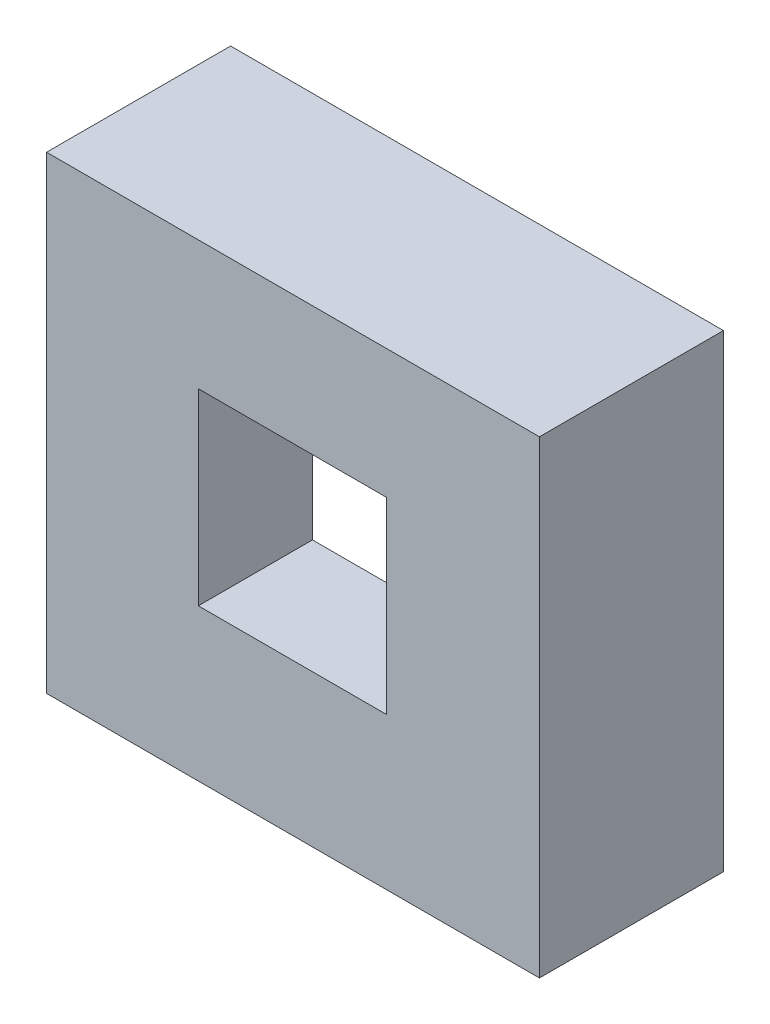
ISO-10303-21;
HEADER;
FILE_DESCRIPTION(('STEP AP214'),'2;1');
FILE_NAME('part.step','',(''),(''),'','','');
FILE_SCHEMA(('AUTOMOTIVE_DESIGN { 1 0 10303 214 1 1 1 1 }'));
ENDSEC;
DATA;
#1=APPLICATION_CONTEXT('core data for automotive mechanical design processes');
#2=APPLICATION_PROTOCOL_DEFINITION('international standard','automotive_design',2000,#1);
#3=PRODUCT_CONTEXT('',#1,'mechanical');
#4=PRODUCT('Part','Part','',(#3));
#5=PRODUCT_RELATED_PRODUCT_CATEGORY('part','',(#4));
#6=PRODUCT_DEFINITION_FORMATION('','',#4);
#7=PRODUCT_DEFINITION_CONTEXT('part definition',#1,'design');
#8=PRODUCT_DEFINITION('design','',#6,#7);
#9=PRODUCT_DEFINITION_SHAPE('','',#8);
#10=(LENGTH_UNIT() NAMED_UNIT(*) SI_UNIT(.MILLI.,.METRE.));
#11=(NAMED_UNIT(*) PLANE_ANGLE_UNIT() SI_UNIT($,.RADIAN.));
#12=(NAMED_UNIT(*) SI_UNIT($,.STERADIAN.) SOLID_ANGLE_UNIT());
#13=UNCERTAINTY_MEASURE_WITH_UNIT(LENGTH_MEASURE(1.E-05),#10,'distance_accuracy_value','');
#14=(GEOMETRIC_REPRESENTATION_CONTEXT(3) GLOBAL_UNCERTAINTY_ASSIGNED_CONTEXT((#13)) GLOBAL_UNIT_ASSIGNED_CONTEXT((#10,
#11,#12)) REPRESENTATION_CONTEXT('',''));
#15=CARTESIAN_POINT('',(0.,0.,0.));
#16=DIRECTION('',(0.,0.,1.));
#17=DIRECTION('',(1.,0.,0.));
#18=AXIS2_PLACEMENT_3D('',#15,#16,#17);
#19=CARTESIAN_POINT('',(0.,0.,11.2));
#20=DIRECTION('',(0.,0.,1.));
#21=DIRECTION('',(1.,0.,0.));
#22=AXIS2_PLACEMENT_3D('',#19,#20,#21);
#23=PLANE('',#22);
#24=DIRECTION('',(0.,-1.,0.));
#25=VECTOR('',#24,1.);
#26=CARTESIAN_POINT('',(1.,1.,11.2));
#27=LINE('',#26,#25);
#28=CARTESIAN_POINT('',(1.,33.9,11.2));
#29=VERTEX_POINT('',#28);
#30=CARTESIAN_POINT('',(1.,1.,11.2));
#31=VERTEX_POINT('',#30);
#32=EDGE_CURVE('E278',#29,#31,#27,.T.);
#33=ORIENTED_EDGE('',*,*,#32,.F.);
#34=DIRECTION('',(-1.,0.,0.));
#35=VECTOR('',#34,1.);
#36=CARTESIAN_POINT('',(1.,33.9,11.2));
#37=LINE('',#36,#35);
#38=CARTESIAN_POINT('',(35.7,33.9,11.2));
#39=VERTEX_POINT('',#38);
#40=EDGE_CURVE('E288',#39,#29,#37,.T.);
#41=ORIENTED_EDGE('',*,*,#40,.F.);
#42=DIRECTION('',(0.,1.,0.));
#43=VECTOR('',#42,1.);
#44=CARTESIAN_POINT('',(35.7,1.,11.2));
#45=LINE('',#44,#43);
#46=CARTESIAN_POINT('',(35.7,1.,11.2));
#47=VERTEX_POINT('',#46);
#48=EDGE_CURVE('E285',#47,#39,#45,.T.);
#49=ORIENTED_EDGE('',*,*,#48,.F.);
#50=DIRECTION('',(1.,0.,0.));
#51=VECTOR('',#50,1.);
#52=CARTESIAN_POINT('',(1.,1.,11.2));
#53=LINE('',#52,#51);
#54=EDGE_CURVE('E281',#31,#47,#53,.T.);
#55=ORIENTED_EDGE('',*,*,#54,.F.);
#56=EDGE_LOOP('',(#33,#41,#49,#55));
#57=FACE_BOUND('',#56,.T.);
#58=DIRECTION('',(0.,1.,0.));
#59=VECTOR('',#58,1.);
#60=CARTESIAN_POINT('',(10.3,10.3,11.2));
#61=LINE('',#60,#59);
#62=CARTESIAN_POINT('',(10.3,10.3,11.2));
#63=VERTEX_POINT('',#62);
#64=CARTESIAN_POINT('',(10.3,26.3,11.2));
#65=VERTEX_POINT('',#64);
#66=EDGE_CURVE('E200',#63,#65,#61,.T.);
#67=ORIENTED_EDGE('',*,*,#66,.F.);
#68=DIRECTION('',(-1.,0.,0.));
#69=VECTOR('',#68,1.);
#70=CARTESIAN_POINT('',(10.3,10.3,11.2));
#71=LINE('',#70,#69);
#72=CARTESIAN_POINT('',(26.3,10.3,11.2));
#73=VERTEX_POINT('',#72);
#74=EDGE_CURVE('E205',#73,#63,#71,.T.);
#75=ORIENTED_EDGE('',*,*,#74,.F.);
#76=DIRECTION('',(0.,-1.,0.));
#77=VECTOR('',#76,1.);
#78=CARTESIAN_POINT('',(26.3,10.3,11.2));
#79=LINE('',#78,#77);
#80=CARTESIAN_POINT('',(26.3,26.3,11.2));
#81=VERTEX_POINT('',#80);
#82=EDGE_CURVE('E55',#81,#73,#79,.T.);
#83=ORIENTED_EDGE('',*,*,#82,.F.);
#84=DIRECTION('',(1.,0.,0.));
#85=VECTOR('',#84,1.);
#86=CARTESIAN_POINT('',(10.3,26.3,11.2));
#87=LINE('',#86,#85);
#88=EDGE_CURVE('E50',#65,#81,#87,.T.);
#89=ORIENTED_EDGE('',*,*,#88,.F.);
#90=EDGE_LOOP('',(#67,#75,#83,#89));
#91=FACE_BOUND('',#90,.T.);
#92=ADVANCED_FACE('F35',(#57,#91),#23,.F.);
#93=CARTESIAN_POINT('',(0.,0.,0.));
#94=DIRECTION('',(0.,0.,-1.));
#95=DIRECTION('',(-1.,0.,0.));
#96=AXIS2_PLACEMENT_3D('',#93,#94,#95);
#97=PLANE('',#96);
#98=DIRECTION('',(0.,-1.,0.));
#99=VECTOR('',#98,1.);
#100=CARTESIAN_POINT('',(30.7,1.,0.));
#101=LINE('',#100,#99);
#102=CARTESIAN_POINT('',(30.7,1.,0.));
#103=VERTEX_POINT('',#102);
#104=CARTESIAN_POINT('',(30.7,0.,0.));
#105=VERTEX_POINT('',#104);
#106=EDGE_CURVE('E252',#103,#105,#101,.T.);
#107=ORIENTED_EDGE('',*,*,#106,.F.);
#108=DIRECTION('',(1.,0.,0.));
#109=VECTOR('',#108,1.);
#110=CARTESIAN_POINT('',(1.,1.,0.));
#111=LINE('',#110,#109);
#112=CARTESIAN_POINT('',(35.7,1.,0.));
#113=VERTEX_POINT('',#112);
#114=EDGE_CURVE('E294',#103,#113,#111,.T.);
#115=ORIENTED_EDGE('',*,*,#114,.T.);
#116=DIRECTION('',(0.,1.,0.));
#117=VECTOR('',#116,1.);
#118=CARTESIAN_POINT('',(35.7,1.,0.));
#119=LINE('',#118,#117);
#120=CARTESIAN_POINT('',(35.7,33.9,0.));
#121=VERTEX_POINT('',#120);
#122=EDGE_CURVE('E298',#113,#121,#119,.T.);
#123=ORIENTED_EDGE('',*,*,#122,.T.);
#124=DIRECTION('',(-1.,0.,0.));
#125=VECTOR('',#124,1.);
#126=CARTESIAN_POINT('',(1.,33.9,0.));
#127=LINE('',#126,#125);
#128=CARTESIAN_POINT('',(1.,33.9,0.));
#129=VERTEX_POINT('',#128);
#130=EDGE_CURVE('E282',#121,#129,#127,.T.);
#131=ORIENTED_EDGE('',*,*,#130,.T.);
#132=DIRECTION('',(0.,-1.,0.));
#133=VECTOR('',#132,1.);
#134=CARTESIAN_POINT('',(1.,1.,0.));
#135=LINE('',#134,#133);
#136=CARTESIAN_POINT('',(1.,1.,0.));
#137=VERTEX_POINT('',#136);
#138=EDGE_CURVE('E270',#129,#137,#135,.T.);
#139=ORIENTED_EDGE('',*,*,#138,.T.);
#140=CARTESIAN_POINT('',(25.8,1.,0.));
#141=VERTEX_POINT('',#140);
#142=EDGE_CURVE('E295',#137,#141,#111,.T.);
#143=ORIENTED_EDGE('',*,*,#142,.T.);
#144=DIRECTION('',(0.,1.,0.));
#145=VECTOR('',#144,1.);
#146=CARTESIAN_POINT('',(25.8,1.,0.));
#147=LINE('',#146,#145);
#148=CARTESIAN_POINT('',(25.8,0.,0.));
#149=VERTEX_POINT('',#148);
#150=EDGE_CURVE('E257',#149,#141,#147,.T.);
#151=ORIENTED_EDGE('',*,*,#150,.F.);
#152=DIRECTION('',(1.,0.,0.));
#153=VECTOR('',#152,1.);
#154=CARTESIAN_POINT('',(0.,0.,0.));
#155=LINE('',#154,#153);
#156=CARTESIAN_POINT('',(0.,0.,0.));
#157=VERTEX_POINT('',#156);
#158=EDGE_CURVE('E317',#157,#149,#155,.T.);
#159=ORIENTED_EDGE('',*,*,#158,.F.);
#160=DIRECTION('',(0.,-1.,0.));
#161=VECTOR('',#160,1.);
#162=CARTESIAN_POINT('',(0.,0.,0.));
#163=LINE('',#162,#161);
#164=CARTESIAN_POINT('',(0.,34.9,0.));
#165=VERTEX_POINT('',#164);
#166=EDGE_CURVE('E313',#165,#157,#163,.T.);
#167=ORIENTED_EDGE('',*,*,#166,.F.);
#168=DIRECTION('',(-1.,0.,0.));
#169=VECTOR('',#168,1.);
#170=CARTESIAN_POINT('',(0.,34.9,0.));
#171=LINE('',#170,#169);
#172=CARTESIAN_POINT('',(36.7,34.9,0.));
#173=VERTEX_POINT('',#172);
#174=EDGE_CURVE('E322',#173,#165,#171,.T.);
#175=ORIENTED_EDGE('',*,*,#174,.F.);
#176=DIRECTION('',(0.,1.,0.));
#177=VECTOR('',#176,1.);
#178=CARTESIAN_POINT('',(36.7,0.,0.));
#179=LINE('',#178,#177);
#180=CARTESIAN_POINT('',(36.7,0.,0.));
#181=VERTEX_POINT('',#180);
#182=EDGE_CURVE('E320',#181,#173,#179,.T.);
#183=ORIENTED_EDGE('',*,*,#182,.F.);
#184=EDGE_CURVE('E316',#105,#181,#155,.T.);
#185=ORIENTED_EDGE('',*,*,#184,.F.);
#186=EDGE_LOOP('',(#107,#115,#123,#131,#139,#143,#151,#159,#167,#175,#183,#185));
#187=FACE_BOUND('',#186,.T.);
#188=ADVANCED_FACE('F340',(#187),#97,.T.);
#189=CARTESIAN_POINT('',(0.,0.,11.2));
#190=DIRECTION('',(1.,0.,0.));
#191=DIRECTION('',(0.,1.,0.));
#192=AXIS2_PLACEMENT_3D('',#189,#190,#191);
#193=PLANE('',#192);
#194=ORIENTED_EDGE('',*,*,#166,.T.);
#195=DIRECTION('',(0.,0.,-1.));
#196=VECTOR('',#195,1.);
#197=CARTESIAN_POINT('',(0.,0.,11.2));
#198=LINE('',#197,#196);
#199=CARTESIAN_POINT('',(0.,0.,13.7));
#200=VERTEX_POINT('',#199);
#201=EDGE_CURVE('E11',#200,#157,#198,.T.);
#202=ORIENTED_EDGE('',*,*,#201,.F.);
#203=DIRECTION('',(0.,-1.,0.));
#204=VECTOR('',#203,1.);
#205=CARTESIAN_POINT('',(0.,0.,13.7));
#206=LINE('',#205,#204);
#207=CARTESIAN_POINT('',(0.,34.9,13.7));
#208=VERTEX_POINT('',#207);
#209=EDGE_CURVE('E246',#208,#200,#206,.T.);
#210=ORIENTED_EDGE('',*,*,#209,.F.);
#211=DIRECTION('',(0.,0.,-1.));
#212=VECTOR('',#211,1.);
#213=CARTESIAN_POINT('',(0.,34.9,11.2));
#214=LINE('',#213,#212);
#215=EDGE_CURVE('E324',#208,#165,#214,.T.);
#216=ORIENTED_EDGE('',*,*,#215,.T.);
#217=EDGE_LOOP('',(#194,#202,#210,#216));
#218=FACE_BOUND('',#217,.T.);
#219=ADVANCED_FACE('F37',(#218),#193,.F.);
#220=CARTESIAN_POINT('',(0.,0.,11.2));
#221=DIRECTION('',(0.,1.,0.));
#222=DIRECTION('',(0.,0.,1.));
#223=AXIS2_PLACEMENT_3D('',#220,#221,#222);
#224=PLANE('',#223);
#225=DIRECTION('',(-1.,0.,0.));
#226=VECTOR('',#225,1.);
#227=CARTESIAN_POINT('',(30.7,0.,1.9));
#228=LINE('',#227,#226);
#229=CARTESIAN_POINT('',(30.7,0.,1.9));
#230=VERTEX_POINT('',#229);
#231=CARTESIAN_POINT('',(25.8,0.,1.9));
#232=VERTEX_POINT('',#231);
#233=EDGE_CURVE('E256',#230,#232,#228,.T.);
#234=ORIENTED_EDGE('',*,*,#233,.F.);
#235=DIRECTION('',(0.,0.,-1.));
#236=VECTOR('',#235,1.);
#237=CARTESIAN_POINT('',(30.7,0.,1.9));
#238=LINE('',#237,#236);
#239=EDGE_CURVE('E265',#230,#105,#238,.T.);
#240=ORIENTED_EDGE('',*,*,#239,.T.);
#241=ORIENTED_EDGE('',*,*,#184,.T.);
#242=DIRECTION('',(0.,0.,-1.));
#243=VECTOR('',#242,1.);
#244=CARTESIAN_POINT('',(36.7,0.,11.2));
#245=LINE('',#244,#243);
#246=CARTESIAN_POINT('',(36.7,0.,13.7));
#247=VERTEX_POINT('',#246);
#248=EDGE_CURVE('E43',#247,#181,#245,.T.);
#249=ORIENTED_EDGE('',*,*,#248,.F.);
#250=DIRECTION('',(1.,0.,0.));
#251=VECTOR('',#250,1.);
#252=CARTESIAN_POINT('',(36.7,0.,13.7));
#253=LINE('',#252,#251);
#254=EDGE_CURVE('E249',#200,#247,#253,.T.);
#255=ORIENTED_EDGE('',*,*,#254,.F.);
#256=ORIENTED_EDGE('',*,*,#201,.T.);
#257=ORIENTED_EDGE('',*,*,#158,.T.);
#258=DIRECTION('',(0.,0.,-1.));
#259=VECTOR('',#258,1.);
#260=CARTESIAN_POINT('',(25.8,0.,1.9));
#261=LINE('',#260,#259);
#262=EDGE_CURVE('E274',#232,#149,#261,.T.);
#263=ORIENTED_EDGE('',*,*,#262,.F.);
#264=EDGE_LOOP('',(#234,#240,#241,#249,#255,#256,#257,#263));
#265=FACE_BOUND('',#264,.T.);
#266=ADVANCED_FACE('F350',(#265),#224,.F.);
#267=CARTESIAN_POINT('',(36.7,0.,11.2));
#268=DIRECTION('',(-1.,0.,0.));
#269=DIRECTION('',(0.,-1.,0.));
#270=AXIS2_PLACEMENT_3D('',#267,#268,#269);
#271=PLANE('',#270);
#272=ORIENTED_EDGE('',*,*,#182,.T.);
#273=DIRECTION('',(0.,0.,-1.));
#274=VECTOR('',#273,1.);
#275=CARTESIAN_POINT('',(36.7,34.9,11.2));
#276=LINE('',#275,#274);
#277=CARTESIAN_POINT('',(36.7,34.9,13.7));
#278=VERTEX_POINT('',#277);
#279=EDGE_CURVE('E327',#278,#173,#276,.T.);
#280=ORIENTED_EDGE('',*,*,#279,.F.);
#281=DIRECTION('',(0.,1.,0.));
#282=VECTOR('',#281,1.);
#283=CARTESIAN_POINT('',(36.7,0.,13.7));
#284=LINE('',#283,#282);
#285=EDGE_CURVE('E180',#247,#278,#284,.T.);
#286=ORIENTED_EDGE('',*,*,#285,.F.);
#287=ORIENTED_EDGE('',*,*,#248,.T.);
#288=EDGE_LOOP('',(#272,#280,#286,#287));
#289=FACE_BOUND('',#288,.T.);
#290=ADVANCED_FACE('F333',(#289),#271,.F.);
#291=CARTESIAN_POINT('',(0.,34.9,11.2));
#292=DIRECTION('',(0.,-1.,0.));
#293=DIRECTION('',(0.,0.,-1.));
#294=AXIS2_PLACEMENT_3D('',#291,#292,#293);
#295=PLANE('',#294);
#296=ORIENTED_EDGE('',*,*,#174,.T.);
#297=ORIENTED_EDGE('',*,*,#215,.F.);
#298=DIRECTION('',(-1.,0.,0.));
#299=VECTOR('',#298,1.);
#300=CARTESIAN_POINT('',(36.7,34.9,13.7));
#301=LINE('',#300,#299);
#302=EDGE_CURVE('E243',#278,#208,#301,.T.);
#303=ORIENTED_EDGE('',*,*,#302,.F.);
#304=ORIENTED_EDGE('',*,*,#279,.T.);
#305=EDGE_LOOP('',(#296,#297,#303,#304));
#306=FACE_BOUND('',#305,.T.);
#307=ADVANCED_FACE('F343',(#306),#295,.F.);
#308=CARTESIAN_POINT('',(1.,1.,11.2));
#309=DIRECTION('',(1.,0.,0.));
#310=DIRECTION('',(0.,0.,-1.));
#311=AXIS2_PLACEMENT_3D('',#308,#309,#310);
#312=PLANE('',#311);
#313=ORIENTED_EDGE('',*,*,#138,.F.);
#314=DIRECTION('',(0.,0.,-1.));
#315=VECTOR('',#314,1.);
#316=CARTESIAN_POINT('',(1.,33.9,11.2));
#317=LINE('',#316,#315);
#318=EDGE_CURVE('E291',#29,#129,#317,.T.);
#319=ORIENTED_EDGE('',*,*,#318,.F.);
#320=ORIENTED_EDGE('',*,*,#32,.T.);
#321=DIRECTION('',(0.,0.,-1.));
#322=VECTOR('',#321,1.);
#323=CARTESIAN_POINT('',(1.,1.,11.2));
#324=LINE('',#323,#322);
#325=EDGE_CURVE('E310',#31,#137,#324,.T.);
#326=ORIENTED_EDGE('',*,*,#325,.T.);
#327=EDGE_LOOP('',(#313,#319,#320,#326));
#328=FACE_BOUND('',#327,.T.);
#329=ADVANCED_FACE('F376',(#328),#312,.T.);
#330=CARTESIAN_POINT('',(1.,1.,11.2));
#331=DIRECTION('',(0.,1.,0.));
#332=DIRECTION('',(0.,0.,1.));
#333=AXIS2_PLACEMENT_3D('',#330,#331,#332);
#334=PLANE('',#333);
#335=DIRECTION('',(0.,0.,-1.));
#336=VECTOR('',#335,1.);
#337=CARTESIAN_POINT('',(30.7,1.,1.9));
#338=LINE('',#337,#336);
#339=CARTESIAN_POINT('',(30.7,1.,1.9));
#340=VERTEX_POINT('',#339);
#341=EDGE_CURVE('E268',#340,#103,#338,.T.);
#342=ORIENTED_EDGE('',*,*,#341,.F.);
#343=DIRECTION('',(1.,0.,0.));
#344=VECTOR('',#343,1.);
#345=CARTESIAN_POINT('',(30.7,1.,1.9));
#346=LINE('',#345,#344);
#347=CARTESIAN_POINT('',(25.8,1.,1.9));
#348=VERTEX_POINT('',#347);
#349=EDGE_CURVE('E262',#348,#340,#346,.T.);
#350=ORIENTED_EDGE('',*,*,#349,.F.);
#351=DIRECTION('',(0.,0.,-1.));
#352=VECTOR('',#351,1.);
#353=CARTESIAN_POINT('',(25.8,1.,1.9));
#354=LINE('',#353,#352);
#355=EDGE_CURVE('E271',#348,#141,#354,.T.);
#356=ORIENTED_EDGE('',*,*,#355,.T.);
#357=ORIENTED_EDGE('',*,*,#142,.F.);
#358=ORIENTED_EDGE('',*,*,#325,.F.);
#359=ORIENTED_EDGE('',*,*,#54,.T.);
#360=DIRECTION('',(0.,0.,-1.));
#361=VECTOR('',#360,1.);
#362=CARTESIAN_POINT('',(35.7,1.,11.2));
#363=LINE('',#362,#361);
#364=EDGE_CURVE('E307',#47,#113,#363,.T.);
#365=ORIENTED_EDGE('',*,*,#364,.T.);
#366=ORIENTED_EDGE('',*,*,#114,.F.);
#367=EDGE_LOOP('',(#342,#350,#356,#357,#358,#359,#365,#366));
#368=FACE_BOUND('',#367,.T.);
#369=ADVANCED_FACE('F359',(#368),#334,.T.);
#370=CARTESIAN_POINT('',(35.7,1.,11.2));
#371=DIRECTION('',(-1.,0.,0.));
#372=DIRECTION('',(0.,0.,1.));
#373=AXIS2_PLACEMENT_3D('',#370,#371,#372);
#374=PLANE('',#373);
#375=ORIENTED_EDGE('',*,*,#122,.F.);
#376=ORIENTED_EDGE('',*,*,#364,.F.);
#377=ORIENTED_EDGE('',*,*,#48,.T.);
#378=DIRECTION('',(0.,0.,-1.));
#379=VECTOR('',#378,1.);
#380=CARTESIAN_POINT('',(35.7,33.9,11.2));
#381=LINE('',#380,#379);
#382=EDGE_CURVE('E305',#39,#121,#381,.T.);
#383=ORIENTED_EDGE('',*,*,#382,.T.);
#384=EDGE_LOOP('',(#375,#376,#377,#383));
#385=FACE_BOUND('',#384,.T.);
#386=ADVANCED_FACE('F369',(#385),#374,.T.);
#387=CARTESIAN_POINT('',(1.,33.9,11.2));
#388=DIRECTION('',(0.,-1.,0.));
#389=DIRECTION('',(0.,0.,-1.));
#390=AXIS2_PLACEMENT_3D('',#387,#388,#389);
#391=PLANE('',#390);
#392=ORIENTED_EDGE('',*,*,#130,.F.);
#393=ORIENTED_EDGE('',*,*,#382,.F.);
#394=ORIENTED_EDGE('',*,*,#40,.T.);
#395=ORIENTED_EDGE('',*,*,#318,.T.);
#396=EDGE_LOOP('',(#392,#393,#394,#395));
#397=FACE_BOUND('',#396,.T.);
#398=ADVANCED_FACE('F373',(#397),#391,.T.);
#399=CARTESIAN_POINT('',(30.7,1.,1.9));
#400=DIRECTION('',(1.,0.,0.));
#401=DIRECTION('',(0.,0.,-1.));
#402=AXIS2_PLACEMENT_3D('',#399,#400,#401);
#403=PLANE('',#402);
#404=ORIENTED_EDGE('',*,*,#106,.T.);
#405=ORIENTED_EDGE('',*,*,#239,.F.);
#406=DIRECTION('',(0.,-1.,0.));
#407=VECTOR('',#406,1.);
#408=CARTESIAN_POINT('',(30.7,1.,1.9));
#409=LINE('',#408,#407);
#410=EDGE_CURVE('E253',#340,#230,#409,.T.);
#411=ORIENTED_EDGE('',*,*,#410,.F.);
#412=ORIENTED_EDGE('',*,*,#341,.T.);
#413=EDGE_LOOP('',(#404,#405,#411,#412));
#414=FACE_BOUND('',#413,.T.);
#415=ADVANCED_FACE('F365',(#414),#403,.F.);
#416=CARTESIAN_POINT('',(25.8,1.,1.9));
#417=DIRECTION('',(-1.,0.,0.));
#418=DIRECTION('',(0.,0.,1.));
#419=AXIS2_PLACEMENT_3D('',#416,#417,#418);
#420=PLANE('',#419);
#421=ORIENTED_EDGE('',*,*,#150,.T.);
#422=ORIENTED_EDGE('',*,*,#355,.F.);
#423=DIRECTION('',(0.,1.,0.));
#424=VECTOR('',#423,1.);
#425=CARTESIAN_POINT('',(25.8,1.,1.9));
#426=LINE('',#425,#424);
#427=EDGE_CURVE('E260',#232,#348,#426,.T.);
#428=ORIENTED_EDGE('',*,*,#427,.F.);
#429=ORIENTED_EDGE('',*,*,#262,.T.);
#430=EDGE_LOOP('',(#421,#422,#428,#429));
#431=FACE_BOUND('',#430,.T.);
#432=ADVANCED_FACE('F355',(#431),#420,.F.);
#433=CARTESIAN_POINT('',(0.,0.,1.9));
#434=DIRECTION('',(0.,0.,-1.));
#435=DIRECTION('',(-1.,0.,0.));
#436=AXIS2_PLACEMENT_3D('',#433,#434,#435);
#437=PLANE('',#436);
#438=ORIENTED_EDGE('',*,*,#410,.T.);
#439=ORIENTED_EDGE('',*,*,#233,.T.);
#440=ORIENTED_EDGE('',*,*,#427,.T.);
#441=ORIENTED_EDGE('',*,*,#349,.T.);
#442=EDGE_LOOP('',(#438,#439,#440,#441));
#443=FACE_BOUND('',#442,.T.);
#444=ADVANCED_FACE('F363',(#443),#437,.T.);
#445=CARTESIAN_POINT('',(0.,0.,13.7));
#446=DIRECTION('',(0.,0.,1.));
#447=DIRECTION('',(1.,0.,0.));
#448=AXIS2_PLACEMENT_3D('',#445,#446,#447);
#449=PLANE('',#448);
#450=DIRECTION('',(0.,-1.,0.));
#451=VECTOR('',#450,1.);
#452=CARTESIAN_POINT('',(11.3,25.3,13.7));
#453=LINE('',#452,#451);
#454=CARTESIAN_POINT('',(11.3,25.3,13.7));
#455=VERTEX_POINT('',#454);
#456=CARTESIAN_POINT('',(11.3,11.3,13.7));
#457=VERTEX_POINT('',#456);
#458=EDGE_CURVE('E228',#455,#457,#453,.T.);
#459=ORIENTED_EDGE('',*,*,#458,.F.);
#460=DIRECTION('',(-1.,0.,0.));
#461=VECTOR('',#460,1.);
#462=CARTESIAN_POINT('',(11.3,25.3,13.7));
#463=LINE('',#462,#461);
#464=CARTESIAN_POINT('',(25.3,25.3,13.7));
#465=VERTEX_POINT('',#464);
#466=EDGE_CURVE('E177',#465,#455,#463,.T.);
#467=ORIENTED_EDGE('',*,*,#466,.F.);
#468=DIRECTION('',(0.,1.,0.));
#469=VECTOR('',#468,1.);
#470=CARTESIAN_POINT('',(25.3,25.3,13.7));
#471=LINE('',#470,#469);
#472=CARTESIAN_POINT('',(25.3,11.3,13.7));
#473=VERTEX_POINT('',#472);
#474=EDGE_CURVE('E233',#473,#465,#471,.T.);
#475=ORIENTED_EDGE('',*,*,#474,.F.);
#476=DIRECTION('',(1.,0.,0.));
#477=VECTOR('',#476,1.);
#478=CARTESIAN_POINT('',(11.3,11.3,13.7));
#479=LINE('',#478,#477);
#480=EDGE_CURVE('E230',#457,#473,#479,.T.);
#481=ORIENTED_EDGE('',*,*,#480,.F.);
#482=EDGE_LOOP('',(#459,#467,#475,#481));
#483=FACE_BOUND('',#482,.T.);
#484=ORIENTED_EDGE('',*,*,#285,.T.);
#485=ORIENTED_EDGE('',*,*,#302,.T.);
#486=ORIENTED_EDGE('',*,*,#209,.T.);
#487=ORIENTED_EDGE('',*,*,#254,.T.);
#488=EDGE_LOOP('',(#484,#485,#486,#487));
#489=FACE_BOUND('',#488,.T.);
#490=ADVANCED_FACE('F348',(#483,#489),#449,.T.);
#491=CARTESIAN_POINT('',(11.3,25.3,0.));
#492=DIRECTION('',(-1.,0.,0.));
#493=DIRECTION('',(0.,-1.,0.));
#494=AXIS2_PLACEMENT_3D('',#491,#492,#493);
#495=PLANE('',#494);
#496=DIRECTION('',(0.,0.,1.));
#497=VECTOR('',#496,1.);
#498=CARTESIAN_POINT('',(11.3,25.3,0.));
#499=LINE('',#498,#497);
#500=CARTESIAN_POINT('',(11.3,25.3,5.2));
#501=VERTEX_POINT('',#500);
#502=EDGE_CURVE('E170',#501,#455,#499,.T.);
#503=ORIENTED_EDGE('',*,*,#502,.T.);
#504=ORIENTED_EDGE('',*,*,#458,.T.);
#505=DIRECTION('',(0.,0.,1.));
#506=VECTOR('',#505,1.);
#507=CARTESIAN_POINT('',(11.3,11.3,0.));
#508=LINE('',#507,#506);
#509=CARTESIAN_POINT('',(11.3,11.3,5.2));
#510=VERTEX_POINT('',#509);
#511=EDGE_CURVE('E187',#510,#457,#508,.T.);
#512=ORIENTED_EDGE('',*,*,#511,.F.);
#513=DIRECTION('',(0.,1.,0.));
#514=VECTOR('',#513,1.);
#515=CARTESIAN_POINT('',(11.3,11.3,5.2));
#516=LINE('',#515,#514);
#517=EDGE_CURVE('E184',#510,#501,#516,.T.);
#518=ORIENTED_EDGE('',*,*,#517,.T.);
#519=EDGE_LOOP('',(#503,#504,#512,#518));
#520=FACE_BOUND('',#519,.T.);
#521=ADVANCED_FACE('F185',(#520),#495,.F.);
#522=CARTESIAN_POINT('',(11.3,25.3,0.));
#523=DIRECTION('',(0.,1.,0.));
#524=DIRECTION('',(0.,0.,1.));
#525=AXIS2_PLACEMENT_3D('',#522,#523,#524);
#526=PLANE('',#525);
#527=DIRECTION('',(0.,0.,1.));
#528=VECTOR('',#527,1.);
#529=CARTESIAN_POINT('',(25.3,25.3,0.));
#530=LINE('',#529,#528);
#531=CARTESIAN_POINT('',(25.3,25.3,5.2));
#532=VERTEX_POINT('',#531);
#533=EDGE_CURVE('E181',#532,#465,#530,.T.);
#534=ORIENTED_EDGE('',*,*,#533,.T.);
#535=ORIENTED_EDGE('',*,*,#466,.T.);
#536=ORIENTED_EDGE('',*,*,#502,.F.);
#537=DIRECTION('',(1.,0.,0.));
#538=VECTOR('',#537,1.);
#539=CARTESIAN_POINT('',(11.3,25.3,5.2));
#540=LINE('',#539,#538);
#541=EDGE_CURVE('E174',#501,#532,#540,.T.);
#542=ORIENTED_EDGE('',*,*,#541,.T.);
#543=EDGE_LOOP('',(#534,#535,#536,#542));
#544=FACE_BOUND('',#543,.T.);
#545=ADVANCED_FACE('F172',(#544),#526,.F.);
#546=CARTESIAN_POINT('',(25.3,25.3,0.));
#547=DIRECTION('',(1.,0.,0.));
#548=DIRECTION('',(0.,0.,-1.));
#549=AXIS2_PLACEMENT_3D('',#546,#547,#548);
#550=PLANE('',#549);
#551=DIRECTION('',(0.,0.,1.));
#552=VECTOR('',#551,1.);
#553=CARTESIAN_POINT('',(25.3,11.3,0.));
#554=LINE('',#553,#552);
#555=CARTESIAN_POINT('',(25.3,11.3,5.2));
#556=VERTEX_POINT('',#555);
#557=EDGE_CURVE('E238',#556,#473,#554,.T.);
#558=ORIENTED_EDGE('',*,*,#557,.T.);
#559=ORIENTED_EDGE('',*,*,#474,.T.);
#560=ORIENTED_EDGE('',*,*,#533,.F.);
#561=DIRECTION('',(0.,-1.,0.));
#562=VECTOR('',#561,1.);
#563=CARTESIAN_POINT('',(25.3,11.3,5.2));
#564=LINE('',#563,#562);
#565=EDGE_CURVE('E194',#532,#556,#564,.T.);
#566=ORIENTED_EDGE('',*,*,#565,.T.);
#567=EDGE_LOOP('',(#558,#559,#560,#566));
#568=FACE_BOUND('',#567,.T.);
#569=ADVANCED_FACE('F408',(#568),#550,.F.);
#570=CARTESIAN_POINT('',(11.3,11.3,0.));
#571=DIRECTION('',(0.,-1.,0.));
#572=DIRECTION('',(1.,0.,0.));
#573=AXIS2_PLACEMENT_3D('',#570,#571,#572);
#574=PLANE('',#573);
#575=ORIENTED_EDGE('',*,*,#511,.T.);
#576=ORIENTED_EDGE('',*,*,#480,.T.);
#577=ORIENTED_EDGE('',*,*,#557,.F.);
#578=DIRECTION('',(-1.,0.,0.));
#579=VECTOR('',#578,1.);
#580=CARTESIAN_POINT('',(11.3,11.3,5.2));
#581=LINE('',#580,#579);
#582=EDGE_CURVE('E196',#556,#510,#581,.T.);
#583=ORIENTED_EDGE('',*,*,#582,.T.);
#584=EDGE_LOOP('',(#575,#576,#577,#583));
#585=FACE_BOUND('',#584,.T.);
#586=ADVANCED_FACE('F411',(#585),#574,.F.);
#587=CARTESIAN_POINT('',(0.,0.,5.2));
#588=DIRECTION('',(0.,0.,-1.));
#589=DIRECTION('',(-1.,0.,0.));
#590=AXIS2_PLACEMENT_3D('',#587,#588,#589);
#591=PLANE('',#590);
#592=DIRECTION('',(0.,1.,0.));
#593=VECTOR('',#592,1.);
#594=CARTESIAN_POINT('',(10.3,10.3,5.2));
#595=LINE('',#594,#593);
#596=CARTESIAN_POINT('',(10.3,10.3,5.2));
#597=VERTEX_POINT('',#596);
#598=CARTESIAN_POINT('',(10.3,26.3,5.2));
#599=VERTEX_POINT('',#598);
#600=EDGE_CURVE('E201',#597,#599,#595,.T.);
#601=ORIENTED_EDGE('',*,*,#600,.T.);
#602=DIRECTION('',(1.,0.,0.));
#603=VECTOR('',#602,1.);
#604=CARTESIAN_POINT('',(10.3,26.3,5.2));
#605=LINE('',#604,#603);
#606=CARTESIAN_POINT('',(26.3,26.3,5.2));
#607=VERTEX_POINT('',#606);
#608=EDGE_CURVE('E204',#599,#607,#605,.T.);
#609=ORIENTED_EDGE('',*,*,#608,.T.);
#610=DIRECTION('',(0.,-1.,0.));
#611=VECTOR('',#610,1.);
#612=CARTESIAN_POINT('',(26.3,10.3,5.2));
#613=LINE('',#612,#611);
#614=CARTESIAN_POINT('',(26.3,10.3,5.2));
#615=VERTEX_POINT('',#614);
#616=EDGE_CURVE('E207',#607,#615,#613,.T.);
#617=ORIENTED_EDGE('',*,*,#616,.T.);
#618=DIRECTION('',(-1.,0.,0.));
#619=VECTOR('',#618,1.);
#620=CARTESIAN_POINT('',(10.3,10.3,5.2));
#621=LINE('',#620,#619);
#622=EDGE_CURVE('E209',#615,#597,#621,.T.);
#623=ORIENTED_EDGE('',*,*,#622,.T.);
#624=EDGE_LOOP('',(#601,#609,#617,#623));
#625=FACE_BOUND('',#624,.T.);
#626=ORIENTED_EDGE('',*,*,#541,.F.);
#627=ORIENTED_EDGE('',*,*,#517,.F.);
#628=ORIENTED_EDGE('',*,*,#582,.F.);
#629=ORIENTED_EDGE('',*,*,#565,.F.);
#630=EDGE_LOOP('',(#626,#627,#628,#629));
#631=FACE_BOUND('',#630,.T.);
#632=ADVANCED_FACE('F192',(#625,#631),#591,.T.);
#633=CARTESIAN_POINT('',(10.3,10.3,5.2));
#634=DIRECTION('',(1.,0.,0.));
#635=DIRECTION('',(0.,0.,-1.));
#636=AXIS2_PLACEMENT_3D('',#633,#634,#635);
#637=PLANE('',#636);
#638=ORIENTED_EDGE('',*,*,#66,.T.);
#639=DIRECTION('',(0.,0.,1.));
#640=VECTOR('',#639,1.);
#641=CARTESIAN_POINT('',(10.3,26.3,5.2));
#642=LINE('',#641,#640);
#643=EDGE_CURVE('E226',#599,#65,#642,.T.);
#644=ORIENTED_EDGE('',*,*,#643,.F.);
#645=ORIENTED_EDGE('',*,*,#600,.F.);
#646=DIRECTION('',(0.,0.,1.));
#647=VECTOR('',#646,1.);
#648=CARTESIAN_POINT('',(10.3,10.3,5.2));
#649=LINE('',#648,#647);
#650=EDGE_CURVE('E211',#597,#63,#649,.T.);
#651=ORIENTED_EDGE('',*,*,#650,.T.);
#652=EDGE_LOOP('',(#638,#644,#645,#651));
#653=FACE_BOUND('',#652,.T.);
#654=ADVANCED_FACE('F388',(#653),#637,.F.);
#655=CARTESIAN_POINT('',(10.3,26.3,5.2));
#656=DIRECTION('',(0.,-1.,0.));
#657=DIRECTION('',(1.,0.,0.));
#658=AXIS2_PLACEMENT_3D('',#655,#656,#657);
#659=PLANE('',#658);
#660=ORIENTED_EDGE('',*,*,#88,.T.);
#661=DIRECTION('',(0.,0.,1.));
#662=VECTOR('',#661,1.);
#663=CARTESIAN_POINT('',(26.3,26.3,5.2));
#664=LINE('',#663,#662);
#665=EDGE_CURVE('E223',#607,#81,#664,.T.);
#666=ORIENTED_EDGE('',*,*,#665,.F.);
#667=ORIENTED_EDGE('',*,*,#608,.F.);
#668=ORIENTED_EDGE('',*,*,#643,.T.);
#669=EDGE_LOOP('',(#660,#666,#667,#668));
#670=FACE_BOUND('',#669,.T.);
#671=ADVANCED_FACE('F395',(#670),#659,.F.);
#672=CARTESIAN_POINT('',(26.3,10.3,5.2));
#673=DIRECTION('',(-1.,0.,0.));
#674=DIRECTION('',(0.,0.,1.));
#675=AXIS2_PLACEMENT_3D('',#672,#673,#674);
#676=PLANE('',#675);
#677=ORIENTED_EDGE('',*,*,#82,.T.);
#678=DIRECTION('',(0.,0.,1.));
#679=VECTOR('',#678,1.);
#680=CARTESIAN_POINT('',(26.3,10.3,5.2));
#681=LINE('',#680,#679);
#682=EDGE_CURVE('E220',#615,#73,#681,.T.);
#683=ORIENTED_EDGE('',*,*,#682,.F.);
#684=ORIENTED_EDGE('',*,*,#616,.F.);
#685=ORIENTED_EDGE('',*,*,#665,.T.);
#686=EDGE_LOOP('',(#677,#683,#684,#685));
#687=FACE_BOUND('',#686,.T.);
#688=ADVANCED_FACE('F393',(#687),#676,.F.);
#689=CARTESIAN_POINT('',(10.3,10.3,5.2));
#690=DIRECTION('',(0.,1.,0.));
#691=DIRECTION('',(-1.,0.,0.));
#692=AXIS2_PLACEMENT_3D('',#689,#690,#691);
#693=PLANE('',#692);
#694=ORIENTED_EDGE('',*,*,#74,.T.);
#695=ORIENTED_EDGE('',*,*,#650,.F.);
#696=ORIENTED_EDGE('',*,*,#622,.F.);
#697=ORIENTED_EDGE('',*,*,#682,.T.);
#698=EDGE_LOOP('',(#694,#695,#696,#697));
#699=FACE_BOUND('',#698,.T.);
#700=ADVANCED_FACE('F384',(#699),#693,.F.);
#701=CLOSED_SHELL('',(#92,#188,#219,#266,#290,#307,#329,#369,#386,#398,#415,#432,#444,#490,#521,
#545,#569,#586,#632,#654,#671,#688,#700));
#702=MANIFOLD_SOLID_BREP('B2',#701);
#703=ADVANCED_BREP_SHAPE_REPRESENTATION('',(#18,#702),#14);
#704=SHAPE_DEFINITION_REPRESENTATION(#9,#703);
ENDSEC;
END-ISO-10303-21;
